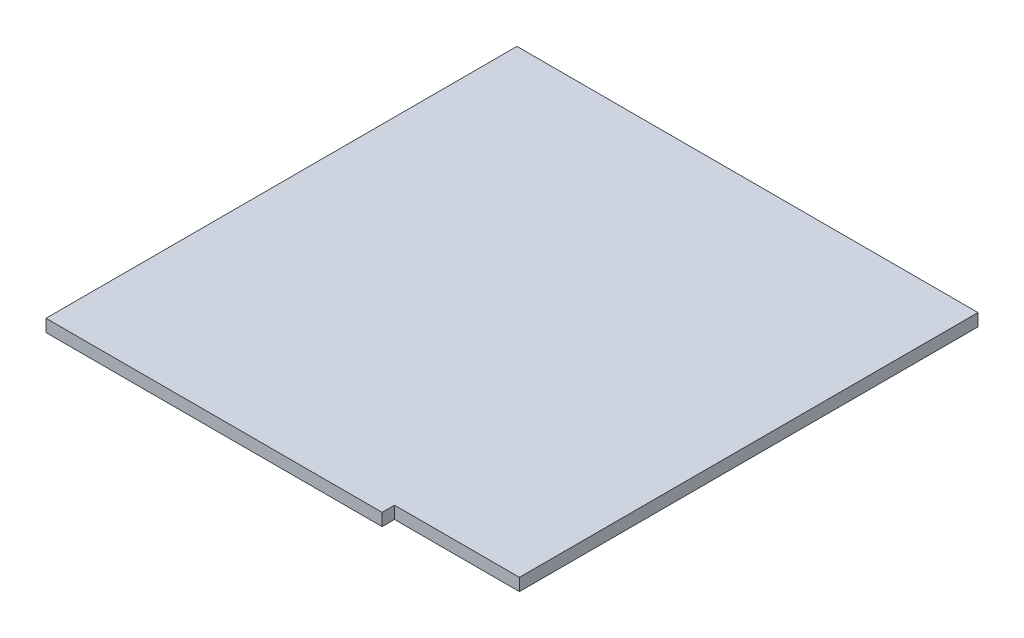
ISO-10303-21;
HEADER;
FILE_DESCRIPTION(('STEP AP214'),'2;1');
FILE_NAME('part.step','',(''),(''),'','','');
FILE_SCHEMA(('AUTOMOTIVE_DESIGN { 1 0 10303 214 1 1 1 1 }'));
ENDSEC;
DATA;
#1=APPLICATION_CONTEXT('core data for automotive mechanical design processes');
#2=APPLICATION_PROTOCOL_DEFINITION('international standard','automotive_design',2000,#1);
#3=PRODUCT_CONTEXT('',#1,'mechanical');
#4=PRODUCT('Part','Part','',(#3));
#5=PRODUCT_RELATED_PRODUCT_CATEGORY('part','',(#4));
#6=PRODUCT_DEFINITION_FORMATION('','',#4);
#7=PRODUCT_DEFINITION_CONTEXT('part definition',#1,'design');
#8=PRODUCT_DEFINITION('design','',#6,#7);
#9=PRODUCT_DEFINITION_SHAPE('','',#8);
#10=(LENGTH_UNIT() NAMED_UNIT(*) SI_UNIT(.MILLI.,.METRE.));
#11=(NAMED_UNIT(*) PLANE_ANGLE_UNIT() SI_UNIT($,.RADIAN.));
#12=(NAMED_UNIT(*) SI_UNIT($,.STERADIAN.) SOLID_ANGLE_UNIT());
#13=UNCERTAINTY_MEASURE_WITH_UNIT(LENGTH_MEASURE(1.E-05),#10,'distance_accuracy_value','');
#14=(GEOMETRIC_REPRESENTATION_CONTEXT(3) GLOBAL_UNCERTAINTY_ASSIGNED_CONTEXT((#13)) GLOBAL_UNIT_ASSIGNED_CONTEXT((#10,
#11,#12)) REPRESENTATION_CONTEXT('',''));
#15=CARTESIAN_POINT('',(0.,0.,0.));
#16=DIRECTION('',(0.,0.,1.));
#17=DIRECTION('',(1.,0.,0.));
#18=AXIS2_PLACEMENT_3D('',#15,#16,#17);
#19=CARTESIAN_POINT('',(0.,15.875,0.));
#20=DIRECTION('',(1.,0.,0.));
#21=DIRECTION('',(0.,0.,-1.));
#22=AXIS2_PLACEMENT_3D('',#19,#20,#21);
#23=PLANE('',#22);
#24=DIRECTION('',(0.,0.,1.));
#25=VECTOR('',#24,1.);
#26=CARTESIAN_POINT('',(0.,0.,0.));
#27=LINE('',#26,#25);
#28=CARTESIAN_POINT('',(0.,0.,-603.25));
#29=VERTEX_POINT('',#28);
#30=CARTESIAN_POINT('',(0.,0.,0.));
#31=VERTEX_POINT('',#30);
#32=EDGE_CURVE('E115',#29,#31,#27,.T.);
#33=ORIENTED_EDGE('',*,*,#32,.T.);
#34=DIRECTION('',(0.,-1.,0.));
#35=VECTOR('',#34,1.);
#36=CARTESIAN_POINT('',(0.,15.875,0.));
#37=LINE('',#36,#35);
#38=CARTESIAN_POINT('',(0.,15.875,0.));
#39=VERTEX_POINT('',#38);
#40=EDGE_CURVE('E11',#39,#31,#37,.T.);
#41=ORIENTED_EDGE('',*,*,#40,.F.);
#42=DIRECTION('',(0.,0.,1.));
#43=VECTOR('',#42,1.);
#44=CARTESIAN_POINT('',(0.,15.875,0.));
#45=LINE('',#44,#43);
#46=CARTESIAN_POINT('',(0.,15.875,-603.25));
#47=VERTEX_POINT('',#46);
#48=EDGE_CURVE('E125',#47,#39,#45,.T.);
#49=ORIENTED_EDGE('',*,*,#48,.F.);
#50=DIRECTION('',(0.,-1.,0.));
#51=VECTOR('',#50,1.);
#52=CARTESIAN_POINT('',(0.,15.875,-603.25));
#53=LINE('',#52,#51);
#54=EDGE_CURVE('E111',#47,#29,#53,.T.);
#55=ORIENTED_EDGE('',*,*,#54,.T.);
#56=EDGE_LOOP('',(#33,#41,#49,#55));
#57=FACE_BOUND('',#56,.T.);
#58=ADVANCED_FACE('F31',(#57),#23,.F.);
#59=CARTESIAN_POINT('',(0.,15.875,0.));
#60=DIRECTION('',(0.,0.,-1.));
#61=DIRECTION('',(-1.,0.,0.));
#62=AXIS2_PLACEMENT_3D('',#59,#60,#61);
#63=PLANE('',#62);
#64=DIRECTION('',(1.,0.,0.));
#65=VECTOR('',#64,1.);
#66=CARTESIAN_POINT('',(0.,0.,0.));
#67=LINE('',#66,#65);
#68=CARTESIAN_POINT('',(430.53,0.,0.));
#69=VERTEX_POINT('',#68);
#70=EDGE_CURVE('E118',#31,#69,#67,.T.);
#71=ORIENTED_EDGE('',*,*,#70,.T.);
#72=DIRECTION('',(0.,-1.,0.));
#73=VECTOR('',#72,1.);
#74=CARTESIAN_POINT('',(430.53,15.875,0.));
#75=LINE('',#74,#73);
#76=CARTESIAN_POINT('',(430.53,15.875,0.));
#77=VERTEX_POINT('',#76);
#78=EDGE_CURVE('E39',#77,#69,#75,.T.);
#79=ORIENTED_EDGE('',*,*,#78,.F.);
#80=DIRECTION('',(1.,0.,0.));
#81=VECTOR('',#80,1.);
#82=CARTESIAN_POINT('',(0.,15.875,0.));
#83=LINE('',#82,#81);
#84=EDGE_CURVE('E84',#39,#77,#83,.T.);
#85=ORIENTED_EDGE('',*,*,#84,.F.);
#86=ORIENTED_EDGE('',*,*,#40,.T.);
#87=EDGE_LOOP('',(#71,#79,#85,#86));
#88=FACE_BOUND('',#87,.T.);
#89=ADVANCED_FACE('F149',(#88),#63,.F.);
#90=CARTESIAN_POINT('',(430.53,15.875,0.));
#91=DIRECTION('',(-1.,0.,0.));
#92=DIRECTION('',(0.,0.,1.));
#93=AXIS2_PLACEMENT_3D('',#90,#91,#92);
#94=PLANE('',#93);
#95=DIRECTION('',(0.,0.,-1.));
#96=VECTOR('',#95,1.);
#97=CARTESIAN_POINT('',(430.53,0.,0.));
#98=LINE('',#97,#96);
#99=CARTESIAN_POINT('',(430.53,0.,-15.875));
#100=VERTEX_POINT('',#99);
#101=EDGE_CURVE('E120',#69,#100,#98,.T.);
#102=ORIENTED_EDGE('',*,*,#101,.T.);
#103=DIRECTION('',(0.,-1.,0.));
#104=VECTOR('',#103,1.);
#105=CARTESIAN_POINT('',(430.53,15.875,-15.875));
#106=LINE('',#105,#104);
#107=CARTESIAN_POINT('',(430.53,15.875,-15.875));
#108=VERTEX_POINT('',#107);
#109=EDGE_CURVE('E106',#108,#100,#106,.T.);
#110=ORIENTED_EDGE('',*,*,#109,.F.);
#111=DIRECTION('',(0.,0.,-1.));
#112=VECTOR('',#111,1.);
#113=CARTESIAN_POINT('',(430.53,15.875,0.));
#114=LINE('',#113,#112);
#115=EDGE_CURVE('E97',#77,#108,#114,.T.);
#116=ORIENTED_EDGE('',*,*,#115,.F.);
#117=ORIENTED_EDGE('',*,*,#78,.T.);
#118=EDGE_LOOP('',(#102,#110,#116,#117));
#119=FACE_BOUND('',#118,.T.);
#120=ADVANCED_FACE('F131',(#119),#94,.F.);
#121=CARTESIAN_POINT('',(430.53,15.875,-15.875));
#122=DIRECTION('',(0.,0.,-1.));
#123=DIRECTION('',(-1.,0.,0.));
#124=AXIS2_PLACEMENT_3D('',#121,#122,#123);
#125=PLANE('',#124);
#126=DIRECTION('',(1.,0.,0.));
#127=VECTOR('',#126,1.);
#128=CARTESIAN_POINT('',(430.53,0.,-15.875));
#129=LINE('',#128,#127);
#130=CARTESIAN_POINT('',(590.55,0.,-15.875));
#131=VERTEX_POINT('',#130);
#132=EDGE_CURVE('E105',#100,#131,#129,.T.);
#133=ORIENTED_EDGE('',*,*,#132,.T.);
#134=DIRECTION('',(0.,-1.,0.));
#135=VECTOR('',#134,1.);
#136=CARTESIAN_POINT('',(590.55,15.875,-15.875));
#137=LINE('',#136,#135);
#138=CARTESIAN_POINT('',(590.55,15.875,-15.875));
#139=VERTEX_POINT('',#138);
#140=EDGE_CURVE('E102',#139,#131,#137,.T.);
#141=ORIENTED_EDGE('',*,*,#140,.F.);
#142=DIRECTION('',(1.,0.,0.));
#143=VECTOR('',#142,1.);
#144=CARTESIAN_POINT('',(430.53,15.875,-15.875));
#145=LINE('',#144,#143);
#146=EDGE_CURVE('E91',#108,#139,#145,.T.);
#147=ORIENTED_EDGE('',*,*,#146,.F.);
#148=ORIENTED_EDGE('',*,*,#109,.T.);
#149=EDGE_LOOP('',(#133,#141,#147,#148));
#150=FACE_BOUND('',#149,.T.);
#151=ADVANCED_FACE('F103',(#150),#125,.F.);
#152=CARTESIAN_POINT('',(590.55,15.875,-15.875));
#153=DIRECTION('',(-1.,0.,0.));
#154=DIRECTION('',(0.,0.,1.));
#155=AXIS2_PLACEMENT_3D('',#152,#153,#154);
#156=PLANE('',#155);
#157=DIRECTION('',(0.,0.,-1.));
#158=VECTOR('',#157,1.);
#159=CARTESIAN_POINT('',(590.55,0.,-15.875));
#160=LINE('',#159,#158);
#161=CARTESIAN_POINT('',(590.55,0.,-603.25));
#162=VERTEX_POINT('',#161);
#163=EDGE_CURVE('E70',#131,#162,#160,.T.);
#164=ORIENTED_EDGE('',*,*,#163,.T.);
#165=DIRECTION('',(0.,-1.,0.));
#166=VECTOR('',#165,1.);
#167=CARTESIAN_POINT('',(590.55,15.875,-603.25));
#168=LINE('',#167,#166);
#169=CARTESIAN_POINT('',(590.55,15.875,-603.25));
#170=VERTEX_POINT('',#169);
#171=EDGE_CURVE('E107',#170,#162,#168,.T.);
#172=ORIENTED_EDGE('',*,*,#171,.F.);
#173=DIRECTION('',(0.,0.,-1.));
#174=VECTOR('',#173,1.);
#175=CARTESIAN_POINT('',(590.55,15.875,-15.875));
#176=LINE('',#175,#174);
#177=EDGE_CURVE('E95',#139,#170,#176,.T.);
#178=ORIENTED_EDGE('',*,*,#177,.F.);
#179=ORIENTED_EDGE('',*,*,#140,.T.);
#180=EDGE_LOOP('',(#164,#172,#178,#179));
#181=FACE_BOUND('',#180,.T.);
#182=ADVANCED_FACE('F109',(#181),#156,.F.);
#183=CARTESIAN_POINT('',(0.,15.875,-603.25));
#184=DIRECTION('',(0.,0.,1.));
#185=DIRECTION('',(1.,0.,0.));
#186=AXIS2_PLACEMENT_3D('',#183,#184,#185);
#187=PLANE('',#186);
#188=DIRECTION('',(-1.,0.,0.));
#189=VECTOR('',#188,1.);
#190=CARTESIAN_POINT('',(0.,0.,-603.25));
#191=LINE('',#190,#189);
#192=EDGE_CURVE('E76',#162,#29,#191,.T.);
#193=ORIENTED_EDGE('',*,*,#192,.T.);
#194=ORIENTED_EDGE('',*,*,#54,.F.);
#195=DIRECTION('',(-1.,0.,0.));
#196=VECTOR('',#195,1.);
#197=CARTESIAN_POINT('',(0.,15.875,-603.25));
#198=LINE('',#197,#196);
#199=EDGE_CURVE('E47',#170,#47,#198,.T.);
#200=ORIENTED_EDGE('',*,*,#199,.F.);
#201=ORIENTED_EDGE('',*,*,#171,.T.);
#202=EDGE_LOOP('',(#193,#194,#200,#201));
#203=FACE_BOUND('',#202,.T.);
#204=ADVANCED_FACE('F138',(#203),#187,.F.);
#205=CARTESIAN_POINT('',(0.,15.875,-603.25));
#206=DIRECTION('',(0.,-1.,0.));
#207=DIRECTION('',(0.,0.,-1.));
#208=AXIS2_PLACEMENT_3D('',#205,#206,#207);
#209=PLANE('',#208);
#210=ORIENTED_EDGE('',*,*,#48,.T.);
#211=ORIENTED_EDGE('',*,*,#84,.T.);
#212=ORIENTED_EDGE('',*,*,#115,.T.);
#213=ORIENTED_EDGE('',*,*,#146,.T.);
#214=ORIENTED_EDGE('',*,*,#177,.T.);
#215=ORIENTED_EDGE('',*,*,#199,.T.);
#216=EDGE_LOOP('',(#210,#211,#212,#213,#214,#215));
#217=FACE_BOUND('',#216,.T.);
#218=ADVANCED_FACE('F93',(#217),#209,.F.);
#219=CARTESIAN_POINT('',(0.,0.,-603.25));
#220=DIRECTION('',(0.,-1.,0.));
#221=DIRECTION('',(0.,0.,-1.));
#222=AXIS2_PLACEMENT_3D('',#219,#220,#221);
#223=PLANE('',#222);
#224=ORIENTED_EDGE('',*,*,#32,.F.);
#225=ORIENTED_EDGE('',*,*,#192,.F.);
#226=ORIENTED_EDGE('',*,*,#163,.F.);
#227=ORIENTED_EDGE('',*,*,#132,.F.);
#228=ORIENTED_EDGE('',*,*,#101,.F.);
#229=ORIENTED_EDGE('',*,*,#70,.F.);
#230=EDGE_LOOP('',(#224,#225,#226,#227,#228,#229));
#231=FACE_BOUND('',#230,.T.);
#232=ADVANCED_FACE('F134',(#231),#223,.T.);
#233=CLOSED_SHELL('',(#58,#89,#120,#151,#182,#204,#218,#232));
#234=MANIFOLD_SOLID_BREP('B2',#233);
#235=ADVANCED_BREP_SHAPE_REPRESENTATION('',(#18,#234),#14);
#236=SHAPE_DEFINITION_REPRESENTATION(#9,#235);
ENDSEC;
END-ISO-10303-21;
